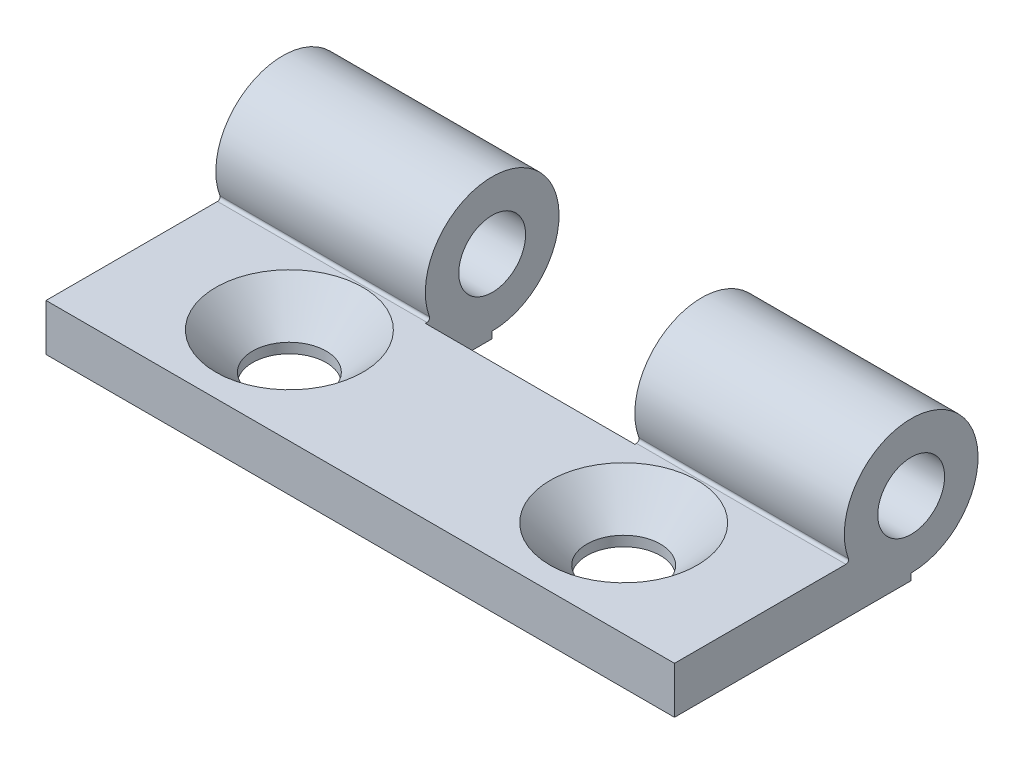
ISO-10303-21;
HEADER;
FILE_DESCRIPTION(('STEP AP214'),'2;1');
FILE_NAME('part.step','',(''),(''),'','','');
FILE_SCHEMA(('AUTOMOTIVE_DESIGN { 1 0 10303 214 1 1 1 1 }'));
ENDSEC;
DATA;
#1=APPLICATION_CONTEXT('core data for automotive mechanical design processes');
#2=APPLICATION_PROTOCOL_DEFINITION('international standard','automotive_design',2000,#1);
#3=PRODUCT_CONTEXT('',#1,'mechanical');
#4=PRODUCT('Part','Part','',(#3));
#5=PRODUCT_RELATED_PRODUCT_CATEGORY('part','',(#4));
#6=PRODUCT_DEFINITION_FORMATION('','',#4);
#7=PRODUCT_DEFINITION_CONTEXT('part definition',#1,'design');
#8=PRODUCT_DEFINITION('design','',#6,#7);
#9=PRODUCT_DEFINITION_SHAPE('','',#8);
#10=(LENGTH_UNIT() NAMED_UNIT(*) SI_UNIT(.MILLI.,.METRE.));
#11=(NAMED_UNIT(*) PLANE_ANGLE_UNIT() SI_UNIT($,.RADIAN.));
#12=(NAMED_UNIT(*) SI_UNIT($,.STERADIAN.) SOLID_ANGLE_UNIT());
#13=UNCERTAINTY_MEASURE_WITH_UNIT(LENGTH_MEASURE(1.E-05),#10,'distance_accuracy_value','');
#14=(GEOMETRIC_REPRESENTATION_CONTEXT(3) GLOBAL_UNCERTAINTY_ASSIGNED_CONTEXT((#13)) GLOBAL_UNIT_ASSIGNED_CONTEXT((#10,
#11,#12)) REPRESENTATION_CONTEXT('',''));
#15=CARTESIAN_POINT('',(0.,0.,0.));
#16=DIRECTION('',(0.,0.,1.));
#17=DIRECTION('',(1.,0.,0.));
#18=AXIS2_PLACEMENT_3D('',#15,#16,#17);
#19=CARTESIAN_POINT('',(61.0107976682072,0.5,10.5));
#20=DIRECTION('',(0.,0.,1.));
#21=DIRECTION('',(1.,0.,0.));
#22=AXIS2_PLACEMENT_3D('',#19,#20,#21);
#23=PLANE('',#22);
#24=DIRECTION('',(0.,1.,0.));
#25=VECTOR('',#24,1.);
#26=CARTESIAN_POINT('',(4.66666666666667,0.5,10.5));
#27=LINE('',#26,#25);
#28=CARTESIAN_POINT('',(4.66666666666667,0.,10.5));
#29=VERTEX_POINT('',#28);
#30=CARTESIAN_POINT('',(4.66666666666667,0.499999999999999,10.5));
#31=VERTEX_POINT('',#30);
#32=EDGE_CURVE('E175',#29,#31,#27,.T.);
#33=ORIENTED_EDGE('',*,*,#32,.F.);
#34=DIRECTION('',(-1.,0.,0.));
#35=VECTOR('',#34,1.);
#36=CARTESIAN_POINT('',(61.0107976682072,0.,10.5));
#37=LINE('',#36,#35);
#38=CARTESIAN_POINT('',(-11.,0.,10.5));
#39=VERTEX_POINT('',#38);
#40=EDGE_CURVE('E155',#29,#39,#37,.T.);
#41=ORIENTED_EDGE('',*,*,#40,.T.);
#42=DIRECTION('',(0.,-1.,0.));
#43=VECTOR('',#42,1.);
#44=CARTESIAN_POINT('',(-11.,0.5,10.5));
#45=LINE('',#44,#43);
#46=CARTESIAN_POINT('',(-11.,0.5,10.5));
#47=VERTEX_POINT('',#46);
#48=EDGE_CURVE('E193',#47,#39,#45,.T.);
#49=ORIENTED_EDGE('',*,*,#48,.F.);
#50=DIRECTION('',(-1.,0.,0.));
#51=VECTOR('',#50,1.);
#52=CARTESIAN_POINT('',(61.0107976682072,0.5,10.5));
#53=LINE('',#52,#51);
#54=EDGE_CURVE('E234',#31,#47,#53,.T.);
#55=ORIENTED_EDGE('',*,*,#54,.F.);
#56=EDGE_LOOP('',(#33,#41,#49,#55));
#57=FACE_BOUND('',#56,.T.);
#58=ADVANCED_FACE('F39',(#57),#23,.F.);
#59=DIRECTION('',(0.,-1.,0.));
#60=VECTOR('',#59,1.);
#61=CARTESIAN_POINT('',(20.3333333333333,0.5,10.5));
#62=LINE('',#61,#60);
#63=CARTESIAN_POINT('',(20.3333333333333,0.499999999999999,10.5));
#64=VERTEX_POINT('',#63);
#65=CARTESIAN_POINT('',(20.3333333333333,0.,10.5));
#66=VERTEX_POINT('',#65);
#67=EDGE_CURVE('E167',#64,#66,#62,.T.);
#68=ORIENTED_EDGE('',*,*,#67,.F.);
#69=CARTESIAN_POINT('',(36.,0.5,10.5));
#70=VERTEX_POINT('',#69);
#71=EDGE_CURVE('E231',#70,#64,#53,.T.);
#72=ORIENTED_EDGE('',*,*,#71,.F.);
#73=DIRECTION('',(0.,1.,0.));
#74=VECTOR('',#73,1.);
#75=CARTESIAN_POINT('',(36.,0.5,10.5));
#76=LINE('',#75,#74);
#77=CARTESIAN_POINT('',(36.,0.,10.5));
#78=VERTEX_POINT('',#77);
#79=EDGE_CURVE('E200',#78,#70,#76,.T.);
#80=ORIENTED_EDGE('',*,*,#79,.F.);
#81=EDGE_CURVE('E228',#78,#66,#37,.T.);
#82=ORIENTED_EDGE('',*,*,#81,.T.);
#83=EDGE_LOOP('',(#68,#72,#80,#82));
#84=FACE_BOUND('',#83,.T.);
#85=ADVANCED_FACE('F260',(#84),#23,.F.);
#86=CARTESIAN_POINT('',(61.0107976682072,0.,28.2));
#87=DIRECTION('',(0.,1.,0.));
#88=DIRECTION('',(0.,0.,1.));
#89=AXIS2_PLACEMENT_3D('',#86,#87,#88);
#90=PLANE('',#89);
#91=CARTESIAN_POINT('',(0.,0.,21.));
#92=DIRECTION('',(0.,1.,0.));
#93=DIRECTION('',(0.,0.,1.));
#94=AXIS2_PLACEMENT_3D('',#91,#92,#93);
#95=CIRCLE('',#94,2.75);
#96=CARTESIAN_POINT('',(0.,0.,23.75));
#97=VERTEX_POINT('',#96);
#98=EDGE_CURVE('E43',#97,#97,#95,.T.);
#99=ORIENTED_EDGE('',*,*,#98,.T.);
#100=EDGE_LOOP('',(#99));
#101=FACE_BOUND('',#100,.T.);
#102=CARTESIAN_POINT('',(25.,0.,21.));
#103=DIRECTION('',(0.,1.,0.));
#104=DIRECTION('',(0.,0.,1.));
#105=AXIS2_PLACEMENT_3D('',#102,#103,#104);
#106=CIRCLE('',#105,2.75);
#107=CARTESIAN_POINT('',(25.,0.,23.75));
#108=VERTEX_POINT('',#107);
#109=EDGE_CURVE('E156',#108,#108,#106,.T.);
#110=ORIENTED_EDGE('',*,*,#109,.T.);
#111=EDGE_LOOP('',(#110));
#112=FACE_BOUND('',#111,.T.);
#113=DIRECTION('',(0.,0.,1.));
#114=VECTOR('',#113,1.);
#115=CARTESIAN_POINT('',(4.66666666666666,0.,5.5));
#116=LINE('',#115,#114);
#117=CARTESIAN_POINT('',(4.66666666666667,0.,15.5));
#118=VERTEX_POINT('',#117);
#119=EDGE_CURVE('E136',#29,#118,#116,.T.);
#120=ORIENTED_EDGE('',*,*,#119,.T.);
#121=DIRECTION('',(1.,0.,0.));
#122=VECTOR('',#121,1.);
#123=CARTESIAN_POINT('',(4.66666666666667,0.,15.5));
#124=LINE('',#123,#122);
#125=CARTESIAN_POINT('',(20.3333333333333,0.,15.5));
#126=VERTEX_POINT('',#125);
#127=EDGE_CURVE('E145',#118,#126,#124,.T.);
#128=ORIENTED_EDGE('',*,*,#127,.T.);
#129=DIRECTION('',(0.,0.,-1.));
#130=VECTOR('',#129,1.);
#131=CARTESIAN_POINT('',(20.3333333333333,0.,5.5));
#132=LINE('',#131,#130);
#133=EDGE_CURVE('E150',#126,#66,#132,.T.);
#134=ORIENTED_EDGE('',*,*,#133,.T.);
#135=ORIENTED_EDGE('',*,*,#81,.F.);
#136=DIRECTION('',(0.,0.,-1.));
#137=VECTOR('',#136,1.);
#138=CARTESIAN_POINT('',(36.,0.,28.2));
#139=LINE('',#138,#137);
#140=CARTESIAN_POINT('',(36.,0.,28.2));
#141=VERTEX_POINT('',#140);
#142=EDGE_CURVE('E203',#141,#78,#139,.T.);
#143=ORIENTED_EDGE('',*,*,#142,.F.);
#144=DIRECTION('',(-1.,0.,0.));
#145=VECTOR('',#144,1.);
#146=CARTESIAN_POINT('',(61.0107976682072,0.,28.2));
#147=LINE('',#146,#145);
#148=CARTESIAN_POINT('',(-11.,0.,28.2));
#149=VERTEX_POINT('',#148);
#150=EDGE_CURVE('E226',#141,#149,#147,.T.);
#151=ORIENTED_EDGE('',*,*,#150,.T.);
#152=DIRECTION('',(0.,0.,1.));
#153=VECTOR('',#152,1.);
#154=CARTESIAN_POINT('',(-11.,0.,28.2));
#155=LINE('',#154,#153);
#156=EDGE_CURVE('E190',#39,#149,#155,.T.);
#157=ORIENTED_EDGE('',*,*,#156,.F.);
#158=ORIENTED_EDGE('',*,*,#40,.F.);
#159=EDGE_LOOP('',(#120,#128,#134,#135,#143,#151,#157,#158));
#160=FACE_BOUND('',#159,.T.);
#161=ADVANCED_FACE('F153',(#101,#112,#160),#90,.F.);
#162=CARTESIAN_POINT('',(61.0107976682072,3.5,28.2));
#163=DIRECTION('',(0.,-1.,0.));
#164=DIRECTION('',(0.,0.,-1.));
#165=AXIS2_PLACEMENT_3D('',#162,#163,#164);
#166=PLANE('',#165);
#167=CARTESIAN_POINT('',(0.,3.5,21.));
#168=DIRECTION('',(0.,1.,0.));
#169=DIRECTION('',(0.,0.,1.));
#170=AXIS2_PLACEMENT_3D('',#167,#168,#169);
#171=CIRCLE('',#170,5.5);
#172=CARTESIAN_POINT('',(0.,3.5,26.5));
#173=VERTEX_POINT('',#172);
#174=EDGE_CURVE('E503',#173,#173,#171,.T.);
#175=ORIENTED_EDGE('',*,*,#174,.F.);
#176=EDGE_LOOP('',(#175));
#177=FACE_BOUND('',#176,.T.);
#178=CARTESIAN_POINT('',(25.,3.5,21.));
#179=DIRECTION('',(0.,1.,0.));
#180=DIRECTION('',(0.,0.,1.));
#181=AXIS2_PLACEMENT_3D('',#178,#179,#180);
#182=CIRCLE('',#181,5.5);
#183=CARTESIAN_POINT('',(25.,3.5,26.5));
#184=VERTEX_POINT('',#183);
#185=EDGE_CURVE('E506',#184,#184,#182,.T.);
#186=ORIENTED_EDGE('',*,*,#185,.F.);
#187=EDGE_LOOP('',(#186));
#188=FACE_BOUND('',#187,.T.);
#189=DIRECTION('',(0.,0.,1.));
#190=VECTOR('',#189,1.);
#191=CARTESIAN_POINT('',(4.66666666666667,3.5,28.2));
#192=LINE('',#191,#190);
#193=CARTESIAN_POINT('',(4.66666666666667,3.5,15.3785243670602));
#194=VERTEX_POINT('',#193);
#195=CARTESIAN_POINT('',(4.66666666666667,3.5,15.5));
#196=VERTEX_POINT('',#195);
#197=EDGE_CURVE('E139',#194,#196,#192,.T.);
#198=ORIENTED_EDGE('',*,*,#197,.F.);
#199=DIRECTION('',(1.,0.,0.));
#200=VECTOR('',#199,1.);
#201=CARTESIAN_POINT('',(-11.,3.5,15.3785243670602));
#202=LINE('',#201,#200);
#203=CARTESIAN_POINT('',(-11.,3.5,15.3785243670602));
#204=VERTEX_POINT('',#203);
#205=EDGE_CURVE('E221',#194,#204,#202,.F.);
#206=ORIENTED_EDGE('',*,*,#205,.T.);
#207=DIRECTION('',(0.,0.,-1.));
#208=VECTOR('',#207,1.);
#209=CARTESIAN_POINT('',(-11.,3.5,28.2));
#210=LINE('',#209,#208);
#211=CARTESIAN_POINT('',(-11.,3.5,28.2));
#212=VERTEX_POINT('',#211);
#213=EDGE_CURVE('E184',#212,#204,#210,.T.);
#214=ORIENTED_EDGE('',*,*,#213,.F.);
#215=DIRECTION('',(-1.,0.,0.));
#216=VECTOR('',#215,1.);
#217=CARTESIAN_POINT('',(61.0107976682072,3.5,28.2));
#218=LINE('',#217,#216);
#219=CARTESIAN_POINT('',(36.,3.5,28.2));
#220=VERTEX_POINT('',#219);
#221=EDGE_CURVE('E224',#220,#212,#218,.T.);
#222=ORIENTED_EDGE('',*,*,#221,.F.);
#223=DIRECTION('',(0.,0.,1.));
#224=VECTOR('',#223,1.);
#225=CARTESIAN_POINT('',(36.,3.5,28.2));
#226=LINE('',#225,#224);
#227=CARTESIAN_POINT('',(36.,3.5,15.3785243670602));
#228=VERTEX_POINT('',#227);
#229=EDGE_CURVE('E236',#228,#220,#226,.T.);
#230=ORIENTED_EDGE('',*,*,#229,.F.);
#231=CARTESIAN_POINT('',(20.3333333333333,3.5,15.3785243670602));
#232=VERTEX_POINT('',#231);
#233=EDGE_CURVE('E218',#228,#232,#202,.F.);
#234=ORIENTED_EDGE('',*,*,#233,.T.);
#235=DIRECTION('',(0.,0.,-1.));
#236=VECTOR('',#235,1.);
#237=CARTESIAN_POINT('',(20.3333333333333,3.5,28.2));
#238=LINE('',#237,#236);
#239=CARTESIAN_POINT('',(20.3333333333333,3.5,15.5));
#240=VERTEX_POINT('',#239);
#241=EDGE_CURVE('E56',#240,#232,#238,.T.);
#242=ORIENTED_EDGE('',*,*,#241,.F.);
#243=DIRECTION('',(1.,0.,0.));
#244=VECTOR('',#243,1.);
#245=CARTESIAN_POINT('',(61.0107976682072,3.5,15.5));
#246=LINE('',#245,#244);
#247=EDGE_CURVE('E181',#196,#240,#246,.T.);
#248=ORIENTED_EDGE('',*,*,#247,.F.);
#249=EDGE_LOOP('',(#198,#206,#214,#222,#230,#234,#242,#248));
#250=FACE_BOUND('',#249,.T.);
#251=ADVANCED_FACE('F251',(#177,#188,#250),#166,.F.);
#252=CARTESIAN_POINT('',(61.0107976682072,5.5,10.5));
#253=DIRECTION('',(-1.,0.,0.));
#254=DIRECTION('',(0.,0.,1.));
#255=AXIS2_PLACEMENT_3D('',#252,#253,#254);
#256=CYLINDRICAL_SURFACE('',#255,5.);
#257=DIRECTION('',(-1.,0.,0.));
#258=VECTOR('',#257,1.);
#259=CARTESIAN_POINT('',(61.0107976682072,3.76923076923077,15.190888814481));
#260=LINE('',#259,#258);
#261=CARTESIAN_POINT('',(-11.,3.76923076923077,15.190888814481));
#262=VERTEX_POINT('',#261);
#263=CARTESIAN_POINT('',(4.66666666666667,3.76923076923077,15.190888814481));
#264=VERTEX_POINT('',#263);
#265=EDGE_CURVE('E214',#262,#264,#260,.F.);
#266=ORIENTED_EDGE('',*,*,#265,.T.);
#267=CARTESIAN_POINT('',(4.66666666666667,5.5,10.5));
#268=DIRECTION('',(1.,0.,0.));
#269=DIRECTION('',(0.,0.,-1.));
#270=AXIS2_PLACEMENT_3D('',#267,#268,#269);
#271=CIRCLE('',#270,5.);
#272=EDGE_CURVE('E173',#31,#264,#271,.T.);
#273=ORIENTED_EDGE('',*,*,#272,.F.);
#274=ORIENTED_EDGE('',*,*,#54,.T.);
#275=CARTESIAN_POINT('',(-11.,5.5,10.5));
#276=DIRECTION('',(1.,0.,0.));
#277=DIRECTION('',(0.,0.,-1.));
#278=AXIS2_PLACEMENT_3D('',#275,#276,#277);
#279=CIRCLE('',#278,5.);
#280=EDGE_CURVE('E187',#262,#47,#279,.F.);
#281=ORIENTED_EDGE('',*,*,#280,.F.);
#282=EDGE_LOOP('',(#266,#273,#274,#281));
#283=FACE_BOUND('',#282,.T.);
#284=ADVANCED_FACE('F301',(#283),#256,.T.);
#285=CARTESIAN_POINT('',(20.3333333333333,5.5,10.5));
#286=DIRECTION('',(-1.,0.,0.));
#287=DIRECTION('',(0.,0.,1.));
#288=AXIS2_PLACEMENT_3D('',#285,#286,#287);
#289=CIRCLE('',#288,5.);
#290=CARTESIAN_POINT('',(20.3333333333333,3.76923076923077,15.190888814481));
#291=VERTEX_POINT('',#290);
#292=EDGE_CURVE('E165',#291,#64,#289,.T.);
#293=ORIENTED_EDGE('',*,*,#292,.F.);
#294=CARTESIAN_POINT('',(36.,3.76923076923077,15.190888814481));
#295=VERTEX_POINT('',#294);
#296=EDGE_CURVE('E217',#291,#295,#260,.F.);
#297=ORIENTED_EDGE('',*,*,#296,.T.);
#298=CARTESIAN_POINT('',(36.,5.5,10.5));
#299=DIRECTION('',(1.,0.,0.));
#300=DIRECTION('',(0.,0.,-1.));
#301=AXIS2_PLACEMENT_3D('',#298,#299,#300);
#302=CIRCLE('',#301,5.);
#303=EDGE_CURVE('E235',#70,#295,#302,.T.);
#304=ORIENTED_EDGE('',*,*,#303,.F.);
#305=ORIENTED_EDGE('',*,*,#71,.T.);
#306=EDGE_LOOP('',(#293,#297,#304,#305));
#307=FACE_BOUND('',#306,.T.);
#308=ADVANCED_FACE('F266',(#307),#256,.T.);
#309=CARTESIAN_POINT('',(61.0107976682072,5.5,10.5));
#310=DIRECTION('',(-1.,0.,0.));
#311=DIRECTION('',(0.,0.,1.));
#312=AXIS2_PLACEMENT_3D('',#309,#310,#311);
#313=CYLINDRICAL_SURFACE('',#312,2.49999999999961);
#314=CARTESIAN_POINT('',(-11.,5.5,10.5));
#315=DIRECTION('',(1.,0.,0.));
#316=DIRECTION('',(0.,0.,-1.));
#317=AXIS2_PLACEMENT_3D('',#314,#315,#316);
#318=CIRCLE('',#317,2.49999999999961);
#319=CARTESIAN_POINT('',(-11.,5.5,8.0000000000004));
#320=VERTEX_POINT('',#319);
#321=EDGE_CURVE('E186',#320,#320,#318,.F.);
#322=ORIENTED_EDGE('',*,*,#321,.T.);
#323=EDGE_LOOP('',(#322));
#324=FACE_BOUND('',#323,.T.);
#325=CARTESIAN_POINT('',(4.66666666666667,5.5,10.5));
#326=DIRECTION('',(1.,0.,0.));
#327=DIRECTION('',(0.,0.,-1.));
#328=AXIS2_PLACEMENT_3D('',#325,#326,#327);
#329=CIRCLE('',#328,2.49999999999961);
#330=CARTESIAN_POINT('',(4.66666666666667,5.5,8.0000000000004));
#331=VERTEX_POINT('',#330);
#332=EDGE_CURVE('E178',#331,#331,#329,.T.);
#333=ORIENTED_EDGE('',*,*,#332,.T.);
#334=EDGE_LOOP('',(#333));
#335=FACE_BOUND('',#334,.T.);
#336=ADVANCED_FACE('F293',(#324,#335),#313,.F.);
#337=CARTESIAN_POINT('',(36.,5.5,10.5));
#338=DIRECTION('',(1.,0.,0.));
#339=DIRECTION('',(0.,0.,-1.));
#340=AXIS2_PLACEMENT_3D('',#337,#338,#339);
#341=CIRCLE('',#340,2.49999999999961);
#342=CARTESIAN_POINT('',(36.,5.5,8.0000000000004));
#343=VERTEX_POINT('',#342);
#344=EDGE_CURVE('E199',#343,#343,#341,.T.);
#345=ORIENTED_EDGE('',*,*,#344,.T.);
#346=EDGE_LOOP('',(#345));
#347=FACE_BOUND('',#346,.T.);
#348=CARTESIAN_POINT('',(20.3333333333333,5.5,10.5));
#349=DIRECTION('',(-1.,0.,0.));
#350=DIRECTION('',(0.,0.,1.));
#351=AXIS2_PLACEMENT_3D('',#348,#349,#350);
#352=CIRCLE('',#351,2.49999999999961);
#353=CARTESIAN_POINT('',(20.3333333333333,5.5,12.9999999999996));
#354=VERTEX_POINT('',#353);
#355=EDGE_CURVE('E170',#354,#354,#352,.T.);
#356=ORIENTED_EDGE('',*,*,#355,.T.);
#357=EDGE_LOOP('',(#356));
#358=FACE_BOUND('',#357,.T.);
#359=ADVANCED_FACE('F314',(#347,#358),#313,.F.);
#360=CARTESIAN_POINT('',(61.0107976682072,3.7,15.3785243670602));
#361=DIRECTION('',(-1.,0.,0.));
#362=DIRECTION('',(0.,0.,1.));
#363=AXIS2_PLACEMENT_3D('',#360,#361,#362);
#364=CYLINDRICAL_SURFACE('',#363,0.2);
#365=CARTESIAN_POINT('',(4.66666666666667,3.7,15.3785243670602));
#366=DIRECTION('',(1.,0.,0.));
#367=DIRECTION('',(0.,0.,-1.));
#368=AXIS2_PLACEMENT_3D('',#365,#366,#367);
#369=CIRCLE('',#368,0.2);
#370=EDGE_CURVE('E11',#264,#194,#369,.F.);
#371=ORIENTED_EDGE('',*,*,#370,.F.);
#372=ORIENTED_EDGE('',*,*,#265,.F.);
#373=CARTESIAN_POINT('',(-11.,3.7,15.3785243670602));
#374=DIRECTION('',(1.,0.,0.));
#375=DIRECTION('',(0.,0.,-1.));
#376=AXIS2_PLACEMENT_3D('',#373,#374,#375);
#377=CIRCLE('',#376,0.2);
#378=EDGE_CURVE('E64',#204,#262,#377,.T.);
#379=ORIENTED_EDGE('',*,*,#378,.F.);
#380=ORIENTED_EDGE('',*,*,#205,.F.);
#381=EDGE_LOOP('',(#371,#372,#379,#380));
#382=FACE_BOUND('',#381,.T.);
#383=ADVANCED_FACE('F41',(#382),#364,.F.);
#384=CARTESIAN_POINT('',(20.3333333333333,3.7,15.3785243670602));
#385=DIRECTION('',(-1.,0.,0.));
#386=DIRECTION('',(0.,0.,1.));
#387=AXIS2_PLACEMENT_3D('',#384,#385,#386);
#388=CIRCLE('',#387,0.2);
#389=EDGE_CURVE('E48',#232,#291,#388,.F.);
#390=ORIENTED_EDGE('',*,*,#389,.F.);
#391=ORIENTED_EDGE('',*,*,#233,.F.);
#392=CARTESIAN_POINT('',(36.,3.7,15.3785243670602));
#393=DIRECTION('',(1.,0.,0.));
#394=DIRECTION('',(0.,0.,-1.));
#395=AXIS2_PLACEMENT_3D('',#392,#393,#394);
#396=CIRCLE('',#395,0.2);
#397=EDGE_CURVE('E211',#295,#228,#396,.F.);
#398=ORIENTED_EDGE('',*,*,#397,.F.);
#399=ORIENTED_EDGE('',*,*,#296,.F.);
#400=EDGE_LOOP('',(#390,#391,#398,#399));
#401=FACE_BOUND('',#400,.T.);
#402=ADVANCED_FACE('F268',(#401),#364,.F.);
#403=CARTESIAN_POINT('',(61.0107976682072,0.,28.2));
#404=DIRECTION('',(0.,0.,-1.));
#405=DIRECTION('',(-1.,0.,0.));
#406=AXIS2_PLACEMENT_3D('',#403,#404,#405);
#407=PLANE('',#406);
#408=DIRECTION('',(0.,-1.,0.));
#409=VECTOR('',#408,1.);
#410=CARTESIAN_POINT('',(36.,0.,28.2));
#411=LINE('',#410,#409);
#412=EDGE_CURVE('E206',#220,#141,#411,.T.);
#413=ORIENTED_EDGE('',*,*,#412,.F.);
#414=ORIENTED_EDGE('',*,*,#221,.T.);
#415=DIRECTION('',(0.,1.,0.));
#416=VECTOR('',#415,1.);
#417=CARTESIAN_POINT('',(-11.,0.,28.2));
#418=LINE('',#417,#416);
#419=EDGE_CURVE('E183',#149,#212,#418,.T.);
#420=ORIENTED_EDGE('',*,*,#419,.F.);
#421=ORIENTED_EDGE('',*,*,#150,.F.);
#422=EDGE_LOOP('',(#413,#414,#420,#421));
#423=FACE_BOUND('',#422,.T.);
#424=ADVANCED_FACE('F247',(#423),#407,.F.);
#425=CARTESIAN_POINT('',(36.,0.,0.));
#426=DIRECTION('',(1.,0.,0.));
#427=DIRECTION('',(0.,0.,-1.));
#428=AXIS2_PLACEMENT_3D('',#425,#426,#427);
#429=PLANE('',#428);
#430=ORIENTED_EDGE('',*,*,#142,.T.);
#431=ORIENTED_EDGE('',*,*,#79,.T.);
#432=ORIENTED_EDGE('',*,*,#303,.T.);
#433=ORIENTED_EDGE('',*,*,#397,.T.);
#434=ORIENTED_EDGE('',*,*,#229,.T.);
#435=ORIENTED_EDGE('',*,*,#412,.T.);
#436=EDGE_LOOP('',(#430,#431,#432,#433,#434,#435));
#437=FACE_BOUND('',#436,.T.);
#438=ORIENTED_EDGE('',*,*,#344,.F.);
#439=EDGE_LOOP('',(#438));
#440=FACE_BOUND('',#439,.T.);
#441=ADVANCED_FACE('F241',(#437,#440),#429,.T.);
#442=CARTESIAN_POINT('',(-11.,0.,0.));
#443=DIRECTION('',(1.,0.,0.));
#444=DIRECTION('',(0.,0.,-1.));
#445=AXIS2_PLACEMENT_3D('',#442,#443,#444);
#446=PLANE('',#445);
#447=ORIENTED_EDGE('',*,*,#213,.T.);
#448=ORIENTED_EDGE('',*,*,#378,.T.);
#449=ORIENTED_EDGE('',*,*,#280,.T.);
#450=ORIENTED_EDGE('',*,*,#48,.T.);
#451=ORIENTED_EDGE('',*,*,#156,.T.);
#452=ORIENTED_EDGE('',*,*,#419,.T.);
#453=EDGE_LOOP('',(#447,#448,#449,#450,#451,#452));
#454=FACE_BOUND('',#453,.T.);
#455=ORIENTED_EDGE('',*,*,#321,.F.);
#456=EDGE_LOOP('',(#455));
#457=FACE_BOUND('',#456,.T.);
#458=ADVANCED_FACE('F254',(#454,#457),#446,.F.);
#459=CARTESIAN_POINT('',(4.66666666666667,10.5,15.5));
#460=DIRECTION('',(0.,0.,-1.));
#461=DIRECTION('',(-1.,0.,0.));
#462=AXIS2_PLACEMENT_3D('',#459,#460,#461);
#463=PLANE('',#462);
#464=ORIENTED_EDGE('',*,*,#247,.T.);
#465=DIRECTION('',(0.,-1.,0.));
#466=VECTOR('',#465,1.);
#467=CARTESIAN_POINT('',(20.3333333333333,10.5,15.5));
#468=LINE('',#467,#466);
#469=EDGE_CURVE('E142',#240,#126,#468,.T.);
#470=ORIENTED_EDGE('',*,*,#469,.T.);
#471=ORIENTED_EDGE('',*,*,#127,.F.);
#472=DIRECTION('',(0.,-1.,0.));
#473=VECTOR('',#472,1.);
#474=CARTESIAN_POINT('',(4.66666666666667,10.5,15.5));
#475=LINE('',#474,#473);
#476=EDGE_CURVE('E132',#196,#118,#475,.T.);
#477=ORIENTED_EDGE('',*,*,#476,.F.);
#478=EDGE_LOOP('',(#464,#470,#471,#477));
#479=FACE_BOUND('',#478,.T.);
#480=ADVANCED_FACE('F146',(#479),#463,.T.);
#481=CARTESIAN_POINT('',(4.66666666666666,10.5,5.5));
#482=DIRECTION('',(1.,0.,0.));
#483=DIRECTION('',(0.,0.,-1.));
#484=AXIS2_PLACEMENT_3D('',#481,#482,#483);
#485=PLANE('',#484);
#486=ORIENTED_EDGE('',*,*,#332,.F.);
#487=EDGE_LOOP('',(#486));
#488=FACE_BOUND('',#487,.T.);
#489=ORIENTED_EDGE('',*,*,#32,.T.);
#490=ORIENTED_EDGE('',*,*,#272,.T.);
#491=ORIENTED_EDGE('',*,*,#370,.T.);
#492=ORIENTED_EDGE('',*,*,#197,.T.);
#493=ORIENTED_EDGE('',*,*,#476,.T.);
#494=ORIENTED_EDGE('',*,*,#119,.F.);
#495=EDGE_LOOP('',(#489,#490,#491,#492,#493,#494));
#496=FACE_BOUND('',#495,.T.);
#497=ADVANCED_FACE('F134',(#488,#496),#485,.T.);
#498=CARTESIAN_POINT('',(20.3333333333333,10.5,5.5));
#499=DIRECTION('',(-1.,0.,0.));
#500=DIRECTION('',(0.,0.,1.));
#501=AXIS2_PLACEMENT_3D('',#498,#499,#500);
#502=PLANE('',#501);
#503=ORIENTED_EDGE('',*,*,#355,.F.);
#504=EDGE_LOOP('',(#503));
#505=FACE_BOUND('',#504,.T.);
#506=ORIENTED_EDGE('',*,*,#67,.T.);
#507=ORIENTED_EDGE('',*,*,#133,.F.);
#508=ORIENTED_EDGE('',*,*,#469,.F.);
#509=ORIENTED_EDGE('',*,*,#241,.T.);
#510=ORIENTED_EDGE('',*,*,#389,.T.);
#511=ORIENTED_EDGE('',*,*,#292,.T.);
#512=EDGE_LOOP('',(#506,#507,#508,#509,#510,#511));
#513=FACE_BOUND('',#512,.T.);
#514=ADVANCED_FACE('F269',(#505,#513),#502,.T.);
#515=CARTESIAN_POINT('',(25.,3.5,21.));
#516=DIRECTION('',(0.,1.,0.));
#517=DIRECTION('',(0.,0.,1.));
#518=AXIS2_PLACEMENT_3D('',#515,#516,#517);
#519=CYLINDRICAL_SURFACE('',#518,2.75);
#520=CARTESIAN_POINT('',(25.,0.750000000000004,21.));
#521=DIRECTION('',(0.,1.,0.));
#522=DIRECTION('',(0.,0.,1.));
#523=AXIS2_PLACEMENT_3D('',#520,#521,#522);
#524=CIRCLE('',#523,2.75);
#525=CARTESIAN_POINT('',(25.,0.750000000000004,23.75));
#526=VERTEX_POINT('',#525);
#527=EDGE_CURVE('E159',#526,#526,#524,.T.);
#528=ORIENTED_EDGE('',*,*,#527,.T.);
#529=EDGE_LOOP('',(#528));
#530=FACE_BOUND('',#529,.T.);
#531=ORIENTED_EDGE('',*,*,#109,.F.);
#532=EDGE_LOOP('',(#531));
#533=FACE_BOUND('',#532,.T.);
#534=ADVANCED_FACE('F271',(#530,#533),#519,.F.);
#535=CARTESIAN_POINT('',(25.,3.5,21.));
#536=DIRECTION('',(0.,1.,0.));
#537=DIRECTION('',(0.,0.,1.));
#538=AXIS2_PLACEMENT_3D('',#535,#536,#537);
#539=CONICAL_SURFACE('',#538,5.5,0.785398163397449);
#540=ORIENTED_EDGE('',*,*,#527,.F.);
#541=EDGE_LOOP('',(#540));
#542=FACE_BOUND('',#541,.T.);
#543=ORIENTED_EDGE('',*,*,#185,.T.);
#544=EDGE_LOOP('',(#543));
#545=FACE_BOUND('',#544,.T.);
#546=ADVANCED_FACE('F278',(#542,#545),#539,.F.);
#547=CARTESIAN_POINT('',(0.,3.5,21.));
#548=DIRECTION('',(0.,1.,0.));
#549=DIRECTION('',(0.,0.,1.));
#550=AXIS2_PLACEMENT_3D('',#547,#548,#549);
#551=CYLINDRICAL_SURFACE('',#550,2.75);
#552=CARTESIAN_POINT('',(0.,0.750000000000004,21.));
#553=DIRECTION('',(0.,1.,0.));
#554=DIRECTION('',(0.,0.,1.));
#555=AXIS2_PLACEMENT_3D('',#552,#553,#554);
#556=CIRCLE('',#555,2.75);
#557=CARTESIAN_POINT('',(0.,0.750000000000004,23.75));
#558=VERTEX_POINT('',#557);
#559=EDGE_CURVE('E500',#558,#558,#556,.T.);
#560=ORIENTED_EDGE('',*,*,#559,.T.);
#561=EDGE_LOOP('',(#560));
#562=FACE_BOUND('',#561,.T.);
#563=ORIENTED_EDGE('',*,*,#98,.F.);
#564=EDGE_LOOP('',(#563));
#565=FACE_BOUND('',#564,.T.);
#566=ADVANCED_FACE('F376',(#562,#565),#551,.F.);
#567=CARTESIAN_POINT('',(0.,3.5,21.));
#568=DIRECTION('',(0.,1.,0.));
#569=DIRECTION('',(0.,0.,1.));
#570=AXIS2_PLACEMENT_3D('',#567,#568,#569);
#571=CONICAL_SURFACE('',#570,5.5,0.785398163397449);
#572=ORIENTED_EDGE('',*,*,#559,.F.);
#573=EDGE_LOOP('',(#572));
#574=FACE_BOUND('',#573,.T.);
#575=ORIENTED_EDGE('',*,*,#174,.T.);
#576=EDGE_LOOP('',(#575));
#577=FACE_BOUND('',#576,.T.);
#578=ADVANCED_FACE('F387',(#574,#577),#571,.F.);
#579=CLOSED_SHELL('',(#58,#85,#161,#251,#284,#308,#336,#359,#383,#402,#424,#441,#458,#480,#497,
#514,#534,#546,#566,#578));
#580=MANIFOLD_SOLID_BREP('B2',#579);
#581=ADVANCED_BREP_SHAPE_REPRESENTATION('',(#18,#580),#14);
#582=SHAPE_DEFINITION_REPRESENTATION(#9,#581);
ENDSEC;
END-ISO-10303-21;
